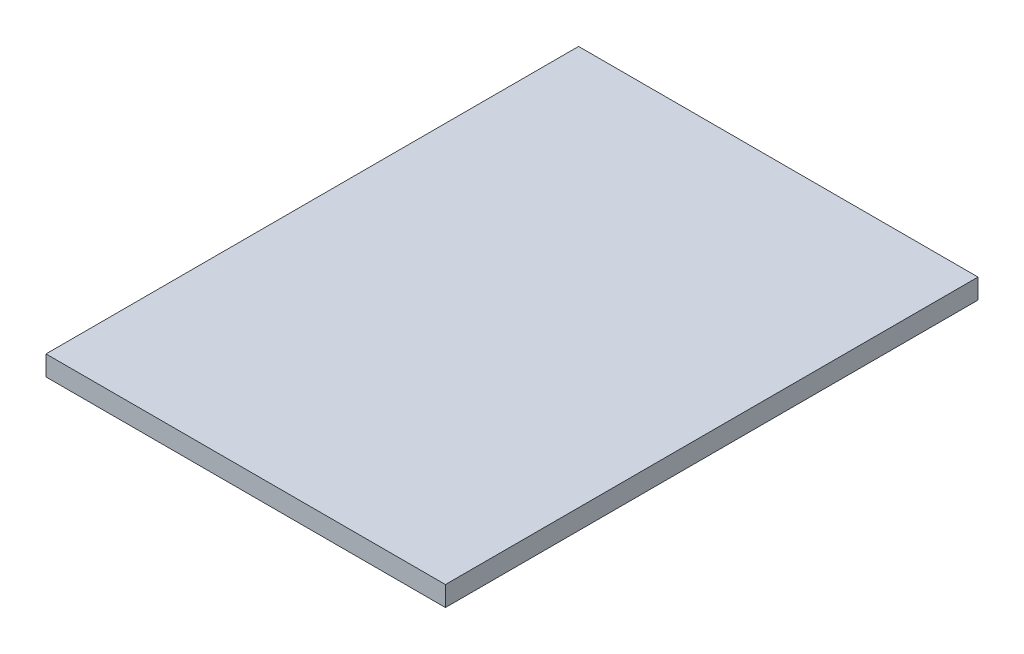
ISO-10303-21;
HEADER;
FILE_DESCRIPTION(('STEP AP214'),'2;1');
FILE_NAME('part.step','',(''),(''),'','','');
FILE_SCHEMA(('AUTOMOTIVE_DESIGN { 1 0 10303 214 1 1 1 1 }'));
ENDSEC;
DATA;
#1=APPLICATION_CONTEXT('core data for automotive mechanical design processes');
#2=APPLICATION_PROTOCOL_DEFINITION('international standard','automotive_design',2000,#1);
#3=PRODUCT_CONTEXT('',#1,'mechanical');
#4=PRODUCT('Part','Part','',(#3));
#5=PRODUCT_RELATED_PRODUCT_CATEGORY('part','',(#4));
#6=PRODUCT_DEFINITION_FORMATION('','',#4);
#7=PRODUCT_DEFINITION_CONTEXT('part definition',#1,'design');
#8=PRODUCT_DEFINITION('design','',#6,#7);
#9=PRODUCT_DEFINITION_SHAPE('','',#8);
#10=(LENGTH_UNIT() NAMED_UNIT(*) SI_UNIT(.MILLI.,.METRE.));
#11=(NAMED_UNIT(*) PLANE_ANGLE_UNIT() SI_UNIT($,.RADIAN.));
#12=(NAMED_UNIT(*) SI_UNIT($,.STERADIAN.) SOLID_ANGLE_UNIT());
#13=UNCERTAINTY_MEASURE_WITH_UNIT(LENGTH_MEASURE(1.E-05),#10,'distance_accuracy_value','');
#14=(GEOMETRIC_REPRESENTATION_CONTEXT(3) GLOBAL_UNCERTAINTY_ASSIGNED_CONTEXT((#13)) GLOBAL_UNIT_ASSIGNED_CONTEXT((#10,
#11,#12)) REPRESENTATION_CONTEXT('',''));
#15=CARTESIAN_POINT('',(0.,0.,0.));
#16=DIRECTION('',(0.,0.,1.));
#17=DIRECTION('',(1.,0.,0.));
#18=AXIS2_PLACEMENT_3D('',#15,#16,#17);
#19=CARTESIAN_POINT('',(0.,0.,0.));
#20=DIRECTION('',(0.,-1.,0.));
#21=DIRECTION('',(0.,0.,-1.));
#22=AXIS2_PLACEMENT_3D('',#19,#20,#21);
#23=PLANE('',#22);
#24=DIRECTION('',(1.,0.,0.));
#25=VECTOR('',#24,1.);
#26=CARTESIAN_POINT('',(0.,0.,-400.));
#27=LINE('',#26,#25);
#28=CARTESIAN_POINT('',(0.,0.,-400.));
#29=VERTEX_POINT('',#28);
#30=CARTESIAN_POINT('',(300.,0.,-400.));
#31=VERTEX_POINT('',#30);
#32=EDGE_CURVE('E172',#29,#31,#27,.T.);
#33=ORIENTED_EDGE('',*,*,#32,.T.);
#34=DIRECTION('',(0.,0.,1.));
#35=VECTOR('',#34,1.);
#36=CARTESIAN_POINT('',(300.,0.,-400.));
#37=LINE('',#36,#35);
#38=CARTESIAN_POINT('',(300.,0.,0.));
#39=VERTEX_POINT('',#38);
#40=EDGE_CURVE('E175',#31,#39,#37,.T.);
#41=ORIENTED_EDGE('',*,*,#40,.T.);
#42=DIRECTION('',(1.,0.,0.));
#43=VECTOR('',#42,1.);
#44=CARTESIAN_POINT('',(0.,0.,0.));
#45=LINE('',#44,#43);
#46=CARTESIAN_POINT('',(0.,0.,0.));
#47=VERTEX_POINT('',#46);
#48=EDGE_CURVE('E179',#47,#39,#45,.T.);
#49=ORIENTED_EDGE('',*,*,#48,.F.);
#50=DIRECTION('',(0.,0.,1.));
#51=VECTOR('',#50,1.);
#52=CARTESIAN_POINT('',(0.,0.,-400.));
#53=LINE('',#52,#51);
#54=EDGE_CURVE('E166',#29,#47,#53,.T.);
#55=ORIENTED_EDGE('',*,*,#54,.F.);
#56=EDGE_LOOP('',(#33,#41,#49,#55));
#57=FACE_BOUND('',#56,.T.);
#58=DIRECTION('',(0.292371704722734,0.,0.956304755963036));
#59=VECTOR('',#58,1.);
#60=CARTESIAN_POINT('',(270.362753857376,0.,-331.96140705156));
#61=LINE('',#60,#59);
#62=CARTESIAN_POINT('',(270.362753857376,0.,-331.96140705156));
#63=VERTEX_POINT('',#62);
#64=CARTESIAN_POINT('',(284.981339093513,0.,-284.146169253408));
#65=VERTEX_POINT('',#64);
#66=EDGE_CURVE('E145',#63,#65,#61,.T.);
#67=ORIENTED_EDGE('',*,*,#66,.F.);
#68=DIRECTION('',(0.956304755963036,0.,-0.292371704722734));
#69=VECTOR('',#68,1.);
#70=CARTESIAN_POINT('',(50.4126599858773,0.,-264.715914965331));
#71=LINE('',#70,#69);
#72=CARTESIAN_POINT('',(50.4126599858774,0.,-264.715914965331));
#73=VERTEX_POINT('',#72);
#74=EDGE_CURVE('E147',#73,#63,#71,.T.);
#75=ORIENTED_EDGE('',*,*,#74,.F.);
#76=DIRECTION('',(0.,0.,-1.));
#77=VECTOR('',#76,1.);
#78=CARTESIAN_POINT('',(50.4126599858774,0.,-34.7159149653308));
#79=LINE('',#78,#77);
#80=CARTESIAN_POINT('',(50.4126599858774,0.,-34.7159149653308));
#81=VERTEX_POINT('',#80);
#82=EDGE_CURVE('E137',#81,#73,#79,.T.);
#83=ORIENTED_EDGE('',*,*,#82,.F.);
#84=DIRECTION('',(1.,0.,0.));
#85=VECTOR('',#84,1.);
#86=CARTESIAN_POINT('',(50.4126599858774,0.,-34.7159149653308));
#87=LINE('',#86,#85);
#88=CARTESIAN_POINT('',(100.412659985877,0.,-34.7159149653308));
#89=VERTEX_POINT('',#88);
#90=EDGE_CURVE('E119',#81,#89,#87,.T.);
#91=ORIENTED_EDGE('',*,*,#90,.T.);
#92=DIRECTION('',(0.,0.,-1.));
#93=VECTOR('',#92,1.);
#94=CARTESIAN_POINT('',(100.412659985877,0.,-34.7159149653308));
#95=LINE('',#94,#93);
#96=CARTESIAN_POINT('',(100.412659985877,0.,-227.717861213906));
#97=VERTEX_POINT('',#96);
#98=EDGE_CURVE('E127',#89,#97,#95,.T.);
#99=ORIENTED_EDGE('',*,*,#98,.T.);
#100=DIRECTION('',(0.956304755963036,0.,-0.292371704722734));
#101=VECTOR('',#100,1.);
#102=CARTESIAN_POINT('',(65.0312452220141,0.,-216.900677167179));
#103=LINE('',#102,#101);
#104=EDGE_CURVE('E124',#97,#65,#103,.T.);
#105=ORIENTED_EDGE('',*,*,#104,.T.);
#106=EDGE_LOOP('',(#67,#75,#83,#91,#99,#105));
#107=FACE_BOUND('',#106,.T.);
#108=ADVANCED_FACE('F32',(#57,#107),#23,.T.);
#109=CARTESIAN_POINT('',(0.,15.,-400.));
#110=DIRECTION('',(0.,0.,-1.));
#111=DIRECTION('',(-1.,0.,0.));
#112=AXIS2_PLACEMENT_3D('',#109,#110,#111);
#113=PLANE('',#112);
#114=ORIENTED_EDGE('',*,*,#32,.F.);
#115=DIRECTION('',(0.,-1.,0.));
#116=VECTOR('',#115,1.);
#117=CARTESIAN_POINT('',(0.,15.,-400.));
#118=LINE('',#117,#116);
#119=CARTESIAN_POINT('',(0.,15.,-400.));
#120=VERTEX_POINT('',#119);
#121=EDGE_CURVE('E11',#120,#29,#118,.T.);
#122=ORIENTED_EDGE('',*,*,#121,.F.);
#123=DIRECTION('',(1.,0.,0.));
#124=VECTOR('',#123,1.);
#125=CARTESIAN_POINT('',(0.,15.,-400.));
#126=LINE('',#125,#124);
#127=CARTESIAN_POINT('',(300.,15.,-400.));
#128=VERTEX_POINT('',#127);
#129=EDGE_CURVE('E163',#120,#128,#126,.T.);
#130=ORIENTED_EDGE('',*,*,#129,.T.);
#131=DIRECTION('',(0.,-1.,0.));
#132=VECTOR('',#131,1.);
#133=CARTESIAN_POINT('',(300.,15.,-400.));
#134=LINE('',#133,#132);
#135=EDGE_CURVE('E36',#128,#31,#134,.T.);
#136=ORIENTED_EDGE('',*,*,#135,.T.);
#137=EDGE_LOOP('',(#114,#122,#130,#136));
#138=FACE_BOUND('',#137,.T.);
#139=ADVANCED_FACE('F34',(#138),#113,.T.);
#140=CARTESIAN_POINT('',(0.,15.,-400.));
#141=DIRECTION('',(1.,0.,0.));
#142=DIRECTION('',(0.,0.,-1.));
#143=AXIS2_PLACEMENT_3D('',#140,#141,#142);
#144=PLANE('',#143);
#145=ORIENTED_EDGE('',*,*,#54,.T.);
#146=DIRECTION('',(0.,-1.,0.));
#147=VECTOR('',#146,1.);
#148=CARTESIAN_POINT('',(0.,15.,0.));
#149=LINE('',#148,#147);
#150=CARTESIAN_POINT('',(0.,15.,0.));
#151=VERTEX_POINT('',#150);
#152=EDGE_CURVE('E41',#151,#47,#149,.T.);
#153=ORIENTED_EDGE('',*,*,#152,.F.);
#154=DIRECTION('',(0.,0.,1.));
#155=VECTOR('',#154,1.);
#156=CARTESIAN_POINT('',(0.,15.,-400.));
#157=LINE('',#156,#155);
#158=EDGE_CURVE('E170',#120,#151,#157,.T.);
#159=ORIENTED_EDGE('',*,*,#158,.F.);
#160=ORIENTED_EDGE('',*,*,#121,.T.);
#161=EDGE_LOOP('',(#145,#153,#159,#160));
#162=FACE_BOUND('',#161,.T.);
#163=ADVANCED_FACE('F191',(#162),#144,.F.);
#164=CARTESIAN_POINT('',(0.,15.,0.));
#165=DIRECTION('',(0.,0.,-1.));
#166=DIRECTION('',(-1.,0.,0.));
#167=AXIS2_PLACEMENT_3D('',#164,#165,#166);
#168=PLANE('',#167);
#169=ORIENTED_EDGE('',*,*,#48,.T.);
#170=DIRECTION('',(0.,-1.,0.));
#171=VECTOR('',#170,1.);
#172=CARTESIAN_POINT('',(300.,15.,0.));
#173=LINE('',#172,#171);
#174=CARTESIAN_POINT('',(300.,15.,0.));
#175=VERTEX_POINT('',#174);
#176=EDGE_CURVE('E184',#175,#39,#173,.T.);
#177=ORIENTED_EDGE('',*,*,#176,.F.);
#178=DIRECTION('',(1.,0.,0.));
#179=VECTOR('',#178,1.);
#180=CARTESIAN_POINT('',(0.,15.,0.));
#181=LINE('',#180,#179);
#182=EDGE_CURVE('E168',#151,#175,#181,.T.);
#183=ORIENTED_EDGE('',*,*,#182,.F.);
#184=ORIENTED_EDGE('',*,*,#152,.T.);
#185=EDGE_LOOP('',(#169,#177,#183,#184));
#186=FACE_BOUND('',#185,.T.);
#187=ADVANCED_FACE('F194',(#186),#168,.F.);
#188=CARTESIAN_POINT('',(300.,15.,-400.));
#189=DIRECTION('',(1.,0.,0.));
#190=DIRECTION('',(0.,0.,-1.));
#191=AXIS2_PLACEMENT_3D('',#188,#189,#190);
#192=PLANE('',#191);
#193=ORIENTED_EDGE('',*,*,#40,.F.);
#194=ORIENTED_EDGE('',*,*,#135,.F.);
#195=DIRECTION('',(0.,0.,1.));
#196=VECTOR('',#195,1.);
#197=CARTESIAN_POINT('',(300.,15.,-400.));
#198=LINE('',#197,#196);
#199=EDGE_CURVE('E165',#128,#175,#198,.T.);
#200=ORIENTED_EDGE('',*,*,#199,.T.);
#201=ORIENTED_EDGE('',*,*,#176,.T.);
#202=EDGE_LOOP('',(#193,#194,#200,#201));
#203=FACE_BOUND('',#202,.T.);
#204=ADVANCED_FACE('F187',(#203),#192,.T.);
#205=CARTESIAN_POINT('',(0.,15.,0.));
#206=DIRECTION('',(0.,-1.,0.));
#207=DIRECTION('',(0.,0.,-1.));
#208=AXIS2_PLACEMENT_3D('',#205,#206,#207);
#209=PLANE('',#208);
#210=ORIENTED_EDGE('',*,*,#129,.F.);
#211=ORIENTED_EDGE('',*,*,#158,.T.);
#212=ORIENTED_EDGE('',*,*,#182,.T.);
#213=ORIENTED_EDGE('',*,*,#199,.F.);
#214=EDGE_LOOP('',(#210,#211,#212,#213));
#215=FACE_BOUND('',#214,.T.);
#216=ADVANCED_FACE('F196',(#215),#209,.F.);
#217=CARTESIAN_POINT('',(272.99409919988,0.,-323.354664247892));
#218=DIRECTION('',(0.956304755963036,0.,-0.292371704722734));
#219=DIRECTION('',(-0.292371704722734,0.,-0.956304755963036));
#220=AXIS2_PLACEMENT_3D('',#217,#218,#219);
#221=PLANE('',#220);
#222=CARTESIAN_POINT('',(272.99409919988,0.,-323.354664247892));
#223=DIRECTION('',(-0.956304755963036,0.,0.292371704722734));
#224=DIRECTION('',(-0.292371704722734,0.,-0.956304755963036));
#225=AXIS2_PLACEMENT_3D('',#222,#223,#224);
#226=CIRCLE('',#225,9.);
#227=CARTESIAN_POINT('',(273.249564060282,8.95748461086103,-322.519076340316));
#228=VERTEX_POINT('',#227);
#229=EDGE_CURVE('E150',#228,#63,#226,.T.);
#230=ORIENTED_EDGE('',*,*,#229,.T.);
#231=ORIENTED_EDGE('',*,*,#66,.T.);
#232=CARTESIAN_POINT('',(283.519480569899,0.,-288.927693033223));
#233=DIRECTION('',(-0.956304755963036,0.,0.292371704722734));
#234=DIRECTION('',(0.292371704722734,0.,0.956304755963036));
#235=AXIS2_PLACEMENT_3D('',#232,#233,#234);
#236=CIRCLE('',#235,4.99999999999999);
#237=CARTESIAN_POINT('',(283.533390393847,4.99977364900023,-288.882196049141));
#238=VERTEX_POINT('',#237);
#239=EDGE_CURVE('E156',#65,#238,#236,.T.);
#240=ORIENTED_EDGE('',*,*,#239,.T.);
#241=DIRECTION('',(-0.290538315528996,0.111813116919015,-0.950308010117997));
#242=VECTOR('',#241,1.);
#243=CARTESIAN_POINT('',(283.533390393847,4.99977364900023,-288.882196049141));
#244=LINE('',#243,#242);
#245=EDGE_CURVE('E153',#238,#228,#244,.T.);
#246=ORIENTED_EDGE('',*,*,#245,.T.);
#247=EDGE_LOOP('',(#230,#231,#240,#246));
#248=FACE_BOUND('',#247,.T.);
#249=ADVANCED_FACE('F198',(#248),#221,.F.);
#250=CARTESIAN_POINT('',(59.4126599858774,0.,-34.7159149653308));
#251=DIRECTION('',(0.,0.,-1.));
#252=DIRECTION('',(-1.,0.,0.));
#253=AXIS2_PLACEMENT_3D('',#250,#251,#252);
#254=PLANE('',#253);
#255=CARTESIAN_POINT('',(59.4126599858774,0.,-34.7159149653308));
#256=DIRECTION('',(0.,0.,1.));
#257=DIRECTION('',(-1.,0.,0.));
#258=AXIS2_PLACEMENT_3D('',#255,#256,#257);
#259=CIRCLE('',#258,9.);
#260=CARTESIAN_POINT('',(60.2864273726502,8.95748461086103,-34.7159149653308));
#261=VERTEX_POINT('',#260);
#262=EDGE_CURVE('E138',#261,#81,#259,.T.);
#263=ORIENTED_EDGE('',*,*,#262,.F.);
#264=DIRECTION('',(-0.993729252304095,0.111813116919015,0.));
#265=VECTOR('',#264,1.);
#266=CARTESIAN_POINT('',(95.4602358070775,4.99977364900023,-34.7159149653308));
#267=LINE('',#266,#265);
#268=CARTESIAN_POINT('',(95.4602358070775,4.99977364900023,-34.7159149653308));
#269=VERTEX_POINT('',#268);
#270=EDGE_CURVE('E122',#269,#261,#267,.T.);
#271=ORIENTED_EDGE('',*,*,#270,.F.);
#272=CARTESIAN_POINT('',(95.4126599858774,0.,-34.7159149653308));
#273=DIRECTION('',(0.,0.,1.));
#274=DIRECTION('',(1.,0.,0.));
#275=AXIS2_PLACEMENT_3D('',#272,#273,#274);
#276=CIRCLE('',#275,4.99999999999999);
#277=EDGE_CURVE('E116',#89,#269,#276,.T.);
#278=ORIENTED_EDGE('',*,*,#277,.F.);
#279=ORIENTED_EDGE('',*,*,#90,.F.);
#280=EDGE_LOOP('',(#263,#271,#278,#279));
#281=FACE_BOUND('',#280,.T.);
#282=ADVANCED_FACE('F117',(#281),#254,.T.);
#283=CARTESIAN_POINT('',(63.5693866984004,0.,-221.682200946994));
#284=DIRECTION('',(0.956304755963036,0.,-0.292371704722734));
#285=DIRECTION('',(-0.292371704722734,0.,-0.956304755963036));
#286=AXIS2_PLACEMENT_3D('',#283,#284,#285);
#287=CYLINDRICAL_SURFACE('',#286,4.99999999999999);
#288=CARTESIAN_POINT('',(95.4126599858774,0.,-231.417666589049));
#289=DIRECTION('',(0.594822786751342,0.,-0.803856860617217));
#290=DIRECTION('',(-0.803856860617217,0.,-0.594822786751342));
#291=AXIS2_PLACEMENT_3D('',#288,#289,#290);
#292=ELLIPSE('',#291,6.2200128467659,4.99999999999999);
#293=CARTESIAN_POINT('',(95.4602358070775,4.99977364900023,-231.382462333248));
#294=VERTEX_POINT('',#293);
#295=EDGE_CURVE('E49',#294,#97,#292,.T.);
#296=ORIENTED_EDGE('',*,*,#295,.F.);
#297=DIRECTION('',(0.956304755963036,0.,-0.292371704722734));
#298=VECTOR('',#297,1.);
#299=CARTESIAN_POINT('',(63.5832965223482,4.99977364900023,-221.636703962912));
#300=LINE('',#299,#298);
#301=EDGE_CURVE('E155',#294,#238,#300,.T.);
#302=ORIENTED_EDGE('',*,*,#301,.T.);
#303=ORIENTED_EDGE('',*,*,#239,.F.);
#304=ORIENTED_EDGE('',*,*,#104,.F.);
#305=EDGE_LOOP('',(#296,#302,#303,#304));
#306=FACE_BOUND('',#305,.T.);
#307=ADVANCED_FACE('F249',(#306),#287,.F.);
#308=CARTESIAN_POINT('',(63.5832965223482,4.99977364900023,-221.636703962912));
#309=DIRECTION('',(-0.0326909916039748,-0.993729252304094,-0.106927415488705));
#310=DIRECTION('',(0.,0.106984598040371,-0.99426067798246));
#311=AXIS2_PLACEMENT_3D('',#308,#309,#310);
#312=PLANE('',#311);
#313=DIRECTION('',(0.800588719905663,-0.0900811965988733,0.592404489837077));
#314=VECTOR('',#313,1.);
#315=CARTESIAN_POINT('',(188.733741823369,-5.49523936331126,-162.363698549757));
#316=LINE('',#315,#314);
#317=CARTESIAN_POINT('',(60.2864273726502,8.95748461086103,-257.409711435233));
#318=VERTEX_POINT('',#317);
#319=EDGE_CURVE('E176',#318,#294,#316,.T.);
#320=ORIENTED_EDGE('',*,*,#319,.F.);
#321=DIRECTION('',(0.956304755963036,0.,-0.292371704722734));
#322=VECTOR('',#321,1.);
#323=CARTESIAN_POINT('',(53.2994701887839,8.95748461086103,-255.273584254087));
#324=LINE('',#323,#322);
#325=EDGE_CURVE('E152',#318,#228,#324,.T.);
#326=ORIENTED_EDGE('',*,*,#325,.T.);
#327=ORIENTED_EDGE('',*,*,#245,.F.);
#328=ORIENTED_EDGE('',*,*,#301,.F.);
#329=EDGE_LOOP('',(#320,#326,#327,#328));
#330=FACE_BOUND('',#329,.T.);
#331=ADVANCED_FACE('F258',(#330),#312,.T.);
#332=CARTESIAN_POINT('',(53.0440053283819,0.,-256.109172161664));
#333=DIRECTION('',(0.956304755963036,0.,-0.292371704722734));
#334=DIRECTION('',(-0.292371704722734,0.,-0.956304755963036));
#335=AXIS2_PLACEMENT_3D('',#332,#333,#334);
#336=CYLINDRICAL_SURFACE('',#335,9.);
#337=CARTESIAN_POINT('',(59.4126599858774,0.,-258.056265290074));
#338=DIRECTION('',(0.594822786751342,0.,-0.803856860617217));
#339=DIRECTION('',(-0.803856860617217,0.,-0.594822786751342));
#340=AXIS2_PLACEMENT_3D('',#337,#338,#339);
#341=ELLIPSE('',#340,11.1960231241786,9.);
#342=EDGE_CURVE('E144',#73,#318,#341,.T.);
#343=ORIENTED_EDGE('',*,*,#342,.F.);
#344=ORIENTED_EDGE('',*,*,#74,.T.);
#345=ORIENTED_EDGE('',*,*,#229,.F.);
#346=ORIENTED_EDGE('',*,*,#325,.F.);
#347=EDGE_LOOP('',(#343,#344,#345,#346));
#348=FACE_BOUND('',#347,.T.);
#349=ADVANCED_FACE('F268',(#348),#336,.F.);
#350=CARTESIAN_POINT('',(59.4126599858774,0.,-34.7159149653308));
#351=DIRECTION('',(0.,0.,-1.));
#352=DIRECTION('',(-1.,0.,0.));
#353=AXIS2_PLACEMENT_3D('',#350,#351,#352);
#354=CYLINDRICAL_SURFACE('',#353,9.);
#355=ORIENTED_EDGE('',*,*,#82,.T.);
#356=ORIENTED_EDGE('',*,*,#342,.T.);
#357=DIRECTION('',(0.,0.,-1.));
#358=VECTOR('',#357,1.);
#359=CARTESIAN_POINT('',(60.2864273726502,8.95748461086103,-34.7159149653308));
#360=LINE('',#359,#358);
#361=EDGE_CURVE('E310',#261,#318,#360,.T.);
#362=ORIENTED_EDGE('',*,*,#361,.F.);
#363=ORIENTED_EDGE('',*,*,#262,.T.);
#364=EDGE_LOOP('',(#355,#356,#362,#363));
#365=FACE_BOUND('',#364,.T.);
#366=ADVANCED_FACE('F278',(#365),#354,.F.);
#367=CARTESIAN_POINT('',(95.4602358070775,4.99977364900023,-34.7159149653308));
#368=DIRECTION('',(-0.111813116919015,-0.993729252304094,0.));
#369=DIRECTION('',(0.993729252304095,-0.111813116919015,0.));
#370=AXIS2_PLACEMENT_3D('',#367,#368,#369);
#371=PLANE('',#370);
#372=ORIENTED_EDGE('',*,*,#361,.T.);
#373=ORIENTED_EDGE('',*,*,#319,.T.);
#374=DIRECTION('',(0.,0.,-1.));
#375=VECTOR('',#374,1.);
#376=CARTESIAN_POINT('',(95.4602358070775,4.99977364900023,-34.7159149653308));
#377=LINE('',#376,#375);
#378=EDGE_CURVE('E131',#269,#294,#377,.T.);
#379=ORIENTED_EDGE('',*,*,#378,.F.);
#380=ORIENTED_EDGE('',*,*,#270,.T.);
#381=EDGE_LOOP('',(#372,#373,#379,#380));
#382=FACE_BOUND('',#381,.T.);
#383=ADVANCED_FACE('F208',(#382),#371,.T.);
#384=CARTESIAN_POINT('',(95.4126599858774,0.,-34.7159149653308));
#385=DIRECTION('',(0.,0.,-1.));
#386=DIRECTION('',(-1.,0.,0.));
#387=AXIS2_PLACEMENT_3D('',#384,#385,#386);
#388=CYLINDRICAL_SURFACE('',#387,4.99999999999999);
#389=ORIENTED_EDGE('',*,*,#378,.T.);
#390=ORIENTED_EDGE('',*,*,#295,.T.);
#391=ORIENTED_EDGE('',*,*,#98,.F.);
#392=ORIENTED_EDGE('',*,*,#277,.T.);
#393=EDGE_LOOP('',(#389,#390,#391,#392));
#394=FACE_BOUND('',#393,.T.);
#395=ADVANCED_FACE('F128',(#394),#388,.F.);
#396=CLOSED_SHELL('',(#108,#139,#163,#187,#204,#216,#249,#282,#307,#331,#349,#366,#383,#395));
#397=MANIFOLD_SOLID_BREP('B2',#396);
#398=ADVANCED_BREP_SHAPE_REPRESENTATION('',(#18,#397),#14);
#399=SHAPE_DEFINITION_REPRESENTATION(#9,#398);
ENDSEC;
END-ISO-10303-21;
